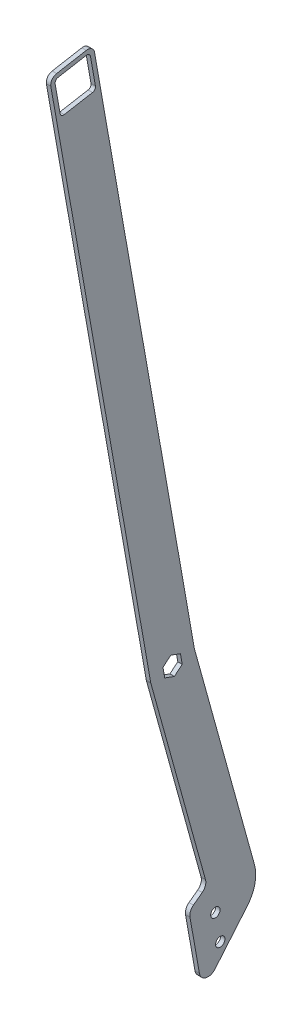
ISO-10303-21;
HEADER;
FILE_DESCRIPTION(('STEP AP214'),'2;1');
FILE_NAME('part.step','',(''),(''),'','','');
FILE_SCHEMA(('AUTOMOTIVE_DESIGN { 1 0 10303 214 1 1 1 1 }'));
ENDSEC;
DATA;
#1=APPLICATION_CONTEXT('core data for automotive mechanical design processes');
#2=APPLICATION_PROTOCOL_DEFINITION('international standard','automotive_design',2000,#1);
#3=PRODUCT_CONTEXT('',#1,'mechanical');
#4=PRODUCT('Part','Part','',(#3));
#5=PRODUCT_RELATED_PRODUCT_CATEGORY('part','',(#4));
#6=PRODUCT_DEFINITION_FORMATION('','',#4);
#7=PRODUCT_DEFINITION_CONTEXT('part definition',#1,'design');
#8=PRODUCT_DEFINITION('design','',#6,#7);
#9=PRODUCT_DEFINITION_SHAPE('','',#8);
#10=(LENGTH_UNIT() NAMED_UNIT(*) SI_UNIT(.MILLI.,.METRE.));
#11=(NAMED_UNIT(*) PLANE_ANGLE_UNIT() SI_UNIT($,.RADIAN.));
#12=(NAMED_UNIT(*) SI_UNIT($,.STERADIAN.) SOLID_ANGLE_UNIT());
#13=UNCERTAINTY_MEASURE_WITH_UNIT(LENGTH_MEASURE(1.E-05),#10,'distance_accuracy_value','');
#14=(GEOMETRIC_REPRESENTATION_CONTEXT(3) GLOBAL_UNCERTAINTY_ASSIGNED_CONTEXT((#13)) GLOBAL_UNIT_ASSIGNED_CONTEXT((#10,
#11,#12)) REPRESENTATION_CONTEXT('',''));
#15=CARTESIAN_POINT('',(0.,0.,0.));
#16=DIRECTION('',(0.,0.,1.));
#17=DIRECTION('',(1.,0.,0.));
#18=AXIS2_PLACEMENT_3D('',#15,#16,#17);
#19=CARTESIAN_POINT('',(1.5875,1029.81232235076,-1069.3559825674));
#20=DIRECTION('',(1.,0.,0.));
#21=DIRECTION('',(0.,0.,-1.));
#22=AXIS2_PLACEMENT_3D('',#19,#20,#21);
#23=CYLINDRICAL_SURFACE('',#22,6.35000000000008);
#24=DIRECTION('',(1.,0.,0.));
#25=VECTOR('',#24,1.);
#26=CARTESIAN_POINT('',(1.5875,1028.11826823169,-1063.23612303946));
#27=LINE('',#26,#25);
#28=CARTESIAN_POINT('',(-1.5875,1028.11826823169,-1063.23612303946));
#29=VERTEX_POINT('',#28);
#30=CARTESIAN_POINT('',(1.5875,1028.11826823169,-1063.23612303946));
#31=VERTEX_POINT('',#30);
#32=EDGE_CURVE('E201',#29,#31,#27,.T.);
#33=ORIENTED_EDGE('',*,*,#32,.F.);
#34=CARTESIAN_POINT('',(-1.5875,1029.81232235076,-1069.3559825674));
#35=DIRECTION('',(1.,0.,0.));
#36=DIRECTION('',(0.,0.,-1.));
#37=AXIS2_PLACEMENT_3D('',#34,#35,#36);
#38=CIRCLE('',#37,6.35000000000008);
#39=CARTESIAN_POINT('',(-1.5875,1028.70965642258,-1063.10245333577));
#40=VERTEX_POINT('',#39);
#41=EDGE_CURVE('E197',#29,#40,#38,.F.);
#42=ORIENTED_EDGE('',*,*,#41,.T.);
#43=DIRECTION('',(1.,0.,0.));
#44=VECTOR('',#43,1.);
#45=CARTESIAN_POINT('',(1.5875,1028.70965642258,-1063.10245333577));
#46=LINE('',#45,#44);
#47=CARTESIAN_POINT('',(1.5875,1028.70965642258,-1063.10245333577));
#48=VERTEX_POINT('',#47);
#49=EDGE_CURVE('E196',#48,#40,#46,.F.);
#50=ORIENTED_EDGE('',*,*,#49,.F.);
#51=CARTESIAN_POINT('',(1.5875,1029.81232235076,-1069.3559825674));
#52=DIRECTION('',(1.,0.,0.));
#53=DIRECTION('',(0.,0.,-1.));
#54=AXIS2_PLACEMENT_3D('',#51,#52,#53);
#55=CIRCLE('',#54,6.35000000000008);
#56=EDGE_CURVE('E20',#31,#48,#55,.F.);
#57=ORIENTED_EDGE('',*,*,#56,.F.);
#58=EDGE_LOOP('',(#33,#42,#50,#57));
#59=FACE_BOUND('',#58,.T.);
#60=ADVANCED_FACE('F17',(#59),#23,.F.);
#61=CARTESIAN_POINT('',(1.5875,1024.29899270983,-1038.08833640926));
#62=DIRECTION('',(1.,0.,0.));
#63=DIRECTION('',(0.,0.,-1.));
#64=AXIS2_PLACEMENT_3D('',#61,#62,#63);
#65=CYLINDRICAL_SURFACE('',#64,6.35000000000008);
#66=CARTESIAN_POINT('',(-1.5875,1024.29899270983,-1038.08833640926));
#67=DIRECTION('',(1.,0.,0.));
#68=DIRECTION('',(0.,0.,-1.));
#69=AXIS2_PLACEMENT_3D('',#66,#67,#68);
#70=CIRCLE('',#69,6.35000000000008);
#71=CARTESIAN_POINT('',(-1.5875,1023.19632678165,-1031.83480717763));
#72=VERTEX_POINT('',#71);
#73=CARTESIAN_POINT('',(-1.5875,1022.60493859076,-1031.96847688132));
#74=VERTEX_POINT('',#73);
#75=EDGE_CURVE('E341',#72,#74,#70,.T.);
#76=ORIENTED_EDGE('',*,*,#75,.T.);
#77=DIRECTION('',(1.,0.,0.));
#78=VECTOR('',#77,1.);
#79=CARTESIAN_POINT('',(1.5875,1022.60493859077,-1031.96847688132));
#80=LINE('',#79,#78);
#81=CARTESIAN_POINT('',(1.5875,1022.60493859076,-1031.96847688132));
#82=VERTEX_POINT('',#81);
#83=EDGE_CURVE('E303',#74,#82,#80,.T.);
#84=ORIENTED_EDGE('',*,*,#83,.T.);
#85=CARTESIAN_POINT('',(1.5875,1024.29899270983,-1038.08833640926));
#86=DIRECTION('',(1.,0.,0.));
#87=DIRECTION('',(0.,0.,-1.));
#88=AXIS2_PLACEMENT_3D('',#85,#86,#87);
#89=CIRCLE('',#88,6.35000000000008);
#90=CARTESIAN_POINT('',(1.5875,1023.19632678165,-1031.83480717763));
#91=VERTEX_POINT('',#90);
#92=EDGE_CURVE('E194',#82,#91,#89,.F.);
#93=ORIENTED_EDGE('',*,*,#92,.T.);
#94=DIRECTION('',(1.,0.,0.));
#95=VECTOR('',#94,1.);
#96=CARTESIAN_POINT('',(1.5875,1023.19632678165,-1031.83480717763));
#97=LINE('',#96,#95);
#98=EDGE_CURVE('E310',#72,#91,#97,.T.);
#99=ORIENTED_EDGE('',*,*,#98,.F.);
#100=EDGE_LOOP('',(#76,#84,#93,#99));
#101=FACE_BOUND('',#100,.T.);
#102=ADVANCED_FACE('F405',(#101),#65,.T.);
#103=CARTESIAN_POINT('',(-1.5875,0.,0.));
#104=DIRECTION('',(1.,0.,0.));
#105=DIRECTION('',(0.,0.,-1.));
#106=AXIS2_PLACEMENT_3D('',#103,#104,#105);
#107=PLANE('',#106);
#108=CARTESIAN_POINT('',(-1.5875,1408.67683289626,-969.538397319688));
#109=DIRECTION('',(-1.,0.,0.));
#110=DIRECTION('',(0.,0.,1.));
#111=AXIS2_PLACEMENT_3D('',#108,#109,#110);
#112=CIRCLE('',#111,2.53999999999999);
#113=CARTESIAN_POINT('',(-1.5875,1408.23576652499,-967.036985627036));
#114=VERTEX_POINT('',#113);
#115=CARTESIAN_POINT('',(-1.5875,1406.17542120361,-969.979463690962));
#116=VERTEX_POINT('',#115);
#117=EDGE_CURVE('E241',#114,#116,#112,.F.);
#118=ORIENTED_EDGE('',*,*,#117,.T.);
#119=DIRECTION('',(0.,-0.173648177666937,0.984807753012207));
#120=VECTOR('',#119,1.);
#121=CARTESIAN_POINT('',(-1.5875,1197.8977864223,211.221699877206));
#122=LINE('',#121,#120);
#123=CARTESIAN_POINT('',(-1.5875,1409.74805881093,-990.240898401436));
#124=VERTEX_POINT('',#123);
#125=EDGE_CURVE('E245',#124,#116,#122,.T.);
#126=ORIENTED_EDGE('',*,*,#125,.F.);
#127=CARTESIAN_POINT('',(-1.5875,1412.24947050358,-989.799832030161));
#128=DIRECTION('',(-1.,0.,0.));
#129=DIRECTION('',(0.,0.,1.));
#130=AXIS2_PLACEMENT_3D('',#127,#128,#129);
#131=CIRCLE('',#130,2.53999999999999);
#132=CARTESIAN_POINT('',(-1.5875,1412.69053687485,-992.301243722812));
#133=VERTEX_POINT('',#132);
#134=EDGE_CURVE('E220',#124,#133,#131,.F.);
#135=ORIENTED_EDGE('',*,*,#134,.T.);
#136=DIRECTION('',(0.,0.984807753012207,0.173648177666935));
#137=VECTOR('',#136,1.);
#138=CARTESIAN_POINT('',(-1.5875,212.2913387599,-1203.96400997129));
#139=LINE('',#138,#137);
#140=CARTESIAN_POINT('',(-1.5875,1432.95197158533,-988.728606115493));
#141=VERTEX_POINT('',#140);
#142=EDGE_CURVE('E226',#133,#141,#139,.T.);
#143=ORIENTED_EDGE('',*,*,#142,.T.);
#144=CARTESIAN_POINT('',(-1.5875,1432.51090521405,-986.227194422842));
#145=DIRECTION('',(1.,0.,0.));
#146=DIRECTION('',(0.,0.,-1.));
#147=AXIS2_PLACEMENT_3D('',#144,#145,#146);
#148=CIRCLE('',#147,2.53999999999999);
#149=CARTESIAN_POINT('',(-1.5875,1435.0123169067,-985.786128051568));
#150=VERTEX_POINT('',#149);
#151=EDGE_CURVE('E229',#141,#150,#148,.T.);
#152=ORIENTED_EDGE('',*,*,#151,.T.);
#153=DIRECTION('',(0.,-0.173648177666945,0.984807753012205));
#154=VECTOR('',#153,1.);
#155=CARTESIAN_POINT('',(-1.5875,1223.16204451806,215.676470227082));
#156=LINE('',#155,#154);
#157=CARTESIAN_POINT('',(-1.5875,1431.43967929938,-965.524693341094));
#158=VERTEX_POINT('',#157);
#159=EDGE_CURVE('E232',#150,#158,#156,.T.);
#160=ORIENTED_EDGE('',*,*,#159,.T.);
#161=CARTESIAN_POINT('',(-1.5875,1428.93826760673,-965.965759712368));
#162=DIRECTION('',(1.,0.,0.));
#163=DIRECTION('',(0.,0.,-1.));
#164=AXIS2_PLACEMENT_3D('',#161,#162,#163);
#165=CIRCLE('',#164,2.53999999999999);
#166=CARTESIAN_POINT('',(-1.5875,1428.49720123546,-963.464348019717));
#167=VERTEX_POINT('',#166);
#168=EDGE_CURVE('E235',#158,#167,#165,.T.);
#169=ORIENTED_EDGE('',*,*,#168,.T.);
#170=DIRECTION('',(0.,-0.984807753012207,-0.173648177666937));
#171=VECTOR('',#170,1.);
#172=CARTESIAN_POINT('',(-1.5875,207.836568410034,-1178.69975187552));
#173=LINE('',#172,#171);
#174=EDGE_CURVE('E238',#167,#114,#173,.T.);
#175=ORIENTED_EDGE('',*,*,#174,.T.);
#176=EDGE_LOOP('',(#118,#126,#135,#143,#152,#160,#169,#175));
#177=FACE_BOUND('',#176,.T.);
#178=DIRECTION('',(0.,0.642787609686544,-0.766044443118974));
#179=VECTOR('',#178,1.);
#180=CARTESIAN_POINT('',(-1.5875,81.21058753333,68.1437740469084));
#181=LINE('',#180,#179);
#182=CARTESIAN_POINT('',(-1.5875,1018.43314955319,-1048.79458130059));
#183=VERTEX_POINT('',#182);
#184=CARTESIAN_POINT('',(-1.5875,1023.14629226664,-1054.41148606176));
#185=VERTEX_POINT('',#184);
#186=EDGE_CURVE('E242',#183,#185,#181,.T.);
#187=ORIENTED_EDGE('',*,*,#186,.T.);
#188=DIRECTION('',(0.,0.984807753012207,0.173648177666934));
#189=VECTOR('',#188,1.);
#190=CARTESIAN_POINT('',(-1.5875,211.16661951315,-1197.58541015503));
#191=LINE('',#190,#189);
#192=CARTESIAN_POINT('',(-1.5875,1030.36724583717,-1053.13823712083));
#193=VERTEX_POINT('',#192);
#194=EDGE_CURVE('E252',#185,#193,#191,.T.);
#195=ORIENTED_EDGE('',*,*,#194,.T.);
#196=DIRECTION('',(0.,0.342020143325652,0.939692620785915));
#197=VECTOR('',#196,1.);
#198=CARTESIAN_POINT('',(-1.5875,1248.30927949546,-454.347420894612));
#199=LINE('',#198,#197);
#200=CARTESIAN_POINT('',(-1.5875,1032.87505669425,-1046.24808341874));
#201=VERTEX_POINT('',#200);
#202=EDGE_CURVE('E258',#193,#201,#199,.T.);
#203=ORIENTED_EDGE('',*,*,#202,.T.);
#204=DIRECTION('',(0.,-0.642787609686544,0.766044443118974));
#205=VECTOR('',#204,1.);
#206=CARTESIAN_POINT('',(-1.5875,90.9393519609409,76.3071766899275));
#207=LINE('',#206,#205);
#208=CARTESIAN_POINT('',(-1.5875,1028.1619139808,-1040.63117865757));
#209=VERTEX_POINT('',#208);
#210=EDGE_CURVE('E264',#201,#209,#207,.T.);
#211=ORIENTED_EDGE('',*,*,#210,.T.);
#212=DIRECTION('',(0.,-0.984807753012227,-0.173648177666822));
#213=VECTOR('',#212,1.);
#214=CARTESIAN_POINT('',(-1.5875,208.961287656628,-1185.0783516917));
#215=LINE('',#214,#213);
#216=CARTESIAN_POINT('',(-1.5875,1020.94096041027,-1041.9044275985));
#217=VERTEX_POINT('',#216);
#218=EDGE_CURVE('E270',#209,#217,#215,.T.);
#219=ORIENTED_EDGE('',*,*,#218,.T.);
#220=DIRECTION('',(0.,-0.342020143325639,-0.939692620785919));
#221=VECTOR('',#220,1.);
#222=CARTESIAN_POINT('',(-1.5875,1236.37518321148,-450.003765074358));
#223=LINE('',#222,#221);
#224=EDGE_CURVE('E276',#217,#183,#223,.T.);
#225=ORIENTED_EDGE('',*,*,#224,.T.);
#226=EDGE_LOOP('',(#187,#195,#203,#211,#219,#225));
#227=FACE_BOUND('',#226,.T.);
#228=CARTESIAN_POINT('',(-1.5875,837.529761972813,-1081.64702736242));
#229=DIRECTION('',(-1.,0.,0.));
#230=DIRECTION('',(0.,0.,1.));
#231=AXIS2_PLACEMENT_3D('',#228,#229,#230);
#232=CIRCLE('',#231,3.35280000000004);
#233=CARTESIAN_POINT('',(-1.5875,837.529761972813,-1078.29422736242));
#234=VERTEX_POINT('',#233);
#235=EDGE_CURVE('E279',#234,#234,#232,.F.);
#236=ORIENTED_EDGE('',*,*,#235,.T.);
#237=EDGE_LOOP('',(#236));
#238=FACE_BOUND('',#237,.T.);
#239=CARTESIAN_POINT('',(-1.5875,857.415984929388,-1078.1405497108));
#240=DIRECTION('',(-1.,0.,0.));
#241=DIRECTION('',(0.,0.,1.));
#242=AXIS2_PLACEMENT_3D('',#239,#240,#241);
#243=CIRCLE('',#242,3.35280000000004);
#244=CARTESIAN_POINT('',(-1.5875,857.415984929388,-1074.7877497108));
#245=VERTEX_POINT('',#244);
#246=EDGE_CURVE('E283',#245,#245,#243,.F.);
#247=ORIENTED_EDGE('',*,*,#246,.T.);
#248=EDGE_LOOP('',(#247));
#249=FACE_BOUND('',#248,.T.);
#250=CARTESIAN_POINT('',(-1.5875,866.455600683505,-1081.63120340782));
#251=DIRECTION('',(1.,0.,0.));
#252=DIRECTION('',(0.,0.,-1.));
#253=AXIS2_PLACEMENT_3D('',#250,#251,#252);
#254=CIRCLE('',#253,25.4000000000001);
#255=CARTESIAN_POINT('',(-1.5875,850.128795397467,-1101.08873226304));
#256=VERTEX_POINT('',#255);
#257=CARTESIAN_POINT('',(-1.5875,873.231817159775,-1106.11064151957));
#258=VERTEX_POINT('',#257);
#259=EDGE_CURVE('E328',#256,#258,#254,.T.);
#260=ORIENTED_EDGE('',*,*,#259,.F.);
#261=DIRECTION('',(0.,-0.766044443118977,0.64278760968654));
#262=VECTOR('',#261,1.);
#263=CARTESIAN_POINT('',(-1.5875,-190.927620496256,-227.538677651876));
#264=LINE('',#263,#262);
#265=CARTESIAN_POINT('',(-1.5875,822.411555806516,-1077.83120674502));
#266=VERTEX_POINT('',#265);
#267=EDGE_CURVE('E333',#256,#266,#264,.T.);
#268=ORIENTED_EDGE('',*,*,#267,.T.);
#269=CARTESIAN_POINT('',(-1.5875,826.493257128025,-1072.96682453122));
#270=DIRECTION('',(1.,0.,0.));
#271=DIRECTION('',(0.,0.,-1.));
#272=AXIS2_PLACEMENT_3D('',#269,#270,#271);
#273=CIRCLE('',#272,6.35000000000008);
#274=CARTESIAN_POINT('',(-1.5875,825.390591199841,-1066.71329529959));
#275=VERTEX_POINT('',#274);
#276=EDGE_CURVE('E284',#275,#266,#273,.T.);
#277=ORIENTED_EDGE('',*,*,#276,.F.);
#278=DIRECTION('',(0.,-0.984807753012207,-0.173648177666934));
#279=VECTOR('',#278,1.);
#280=CARTESIAN_POINT('',(-1.5875,207.307288764502,-1175.69805784433));
#281=LINE('',#280,#279);
#282=CARTESIAN_POINT('',(-1.5875,863.641196979978,-1059.96868147211));
#283=VERTEX_POINT('',#282);
#284=EDGE_CURVE('E288',#283,#275,#281,.T.);
#285=ORIENTED_EDGE('',*,*,#284,.F.);
#286=CARTESIAN_POINT('',(-1.5875,864.743862908163,-1066.22221070374));
#287=DIRECTION('',(-1.,0.,0.));
#288=DIRECTION('',(0.,0.,1.));
#289=AXIS2_PLACEMENT_3D('',#286,#287,#288);
#290=CIRCLE('',#289,6.35000000000008);
#291=CARTESIAN_POINT('',(-1.5875,869.847939873459,-1062.44452644849));
#292=VERTEX_POINT('',#291);
#293=EDGE_CURVE('E292',#292,#283,#290,.F.);
#294=ORIENTED_EDGE('',*,*,#293,.F.);
#295=DIRECTION('',(0.,-0.594910906338142,0.80379164807799));
#296=VECTOR('',#295,1.);
#297=CARTESIAN_POINT('',(-1.5875,53.9478212079292,39.9284407676045));
#298=LINE('',#297,#296);
#299=CARTESIAN_POINT('',(-1.5875,874.507260884624,-1068.73979398282));
#300=VERTEX_POINT('',#299);
#301=EDGE_CURVE('E296',#300,#292,#298,.T.);
#302=ORIENTED_EDGE('',*,*,#301,.F.);
#303=CARTESIAN_POINT('',(-1.5875,879.611337849919,-1064.96210972757));
#304=DIRECTION('',(-1.,0.,0.));
#305=DIRECTION('',(0.,0.,1.));
#306=AXIS2_PLACEMENT_3D('',#303,#304,#305);
#307=CIRCLE('',#306,6.35000000000008);
#308=CARTESIAN_POINT('',(-1.5875,881.305391968987,-1071.08196925551));
#309=VERTEX_POINT('',#308);
#310=EDGE_CURVE('E302',#300,#309,#307,.F.);
#311=ORIENTED_EDGE('',*,*,#310,.T.);
#312=DIRECTION('',(0.,0.963757405974189,0.266780176231111));
#313=VECTOR('',#312,1.);
#314=CARTESIAN_POINT('',(-1.5875,338.111323005632,-1221.44492215988));
#315=LINE('',#314,#313);
#316=EDGE_CURVE('E306',#309,#74,#315,.T.);
#317=ORIENTED_EDGE('',*,*,#316,.T.);
#318=ORIENTED_EDGE('',*,*,#75,.F.);
#319=DIRECTION('',(0.,-0.984807753012207,-0.173648177666935));
#320=VECTOR('',#319,1.);
#321=CARTESIAN_POINT('',(-1.5875,207.307288764503,-1175.69805784433));
#322=LINE('',#321,#320);
#323=CARTESIAN_POINT('',(-1.5875,1428.46820392846,-960.374440714282));
#324=VERTEX_POINT('',#323);
#325=EDGE_CURVE('E313',#324,#72,#322,.T.);
#326=ORIENTED_EDGE('',*,*,#325,.F.);
#327=CARTESIAN_POINT('',(-1.5875,1429.35033667101,-965.377264099584));
#328=DIRECTION('',(-1.,0.,0.));
#329=DIRECTION('',(0.,0.,1.));
#330=AXIS2_PLACEMENT_3D('',#327,#328,#329);
#331=CIRCLE('',#330,5.07999999999997);
#332=CARTESIAN_POINT('',(-1.5875,1434.35316005631,-964.495131357036));
#333=VERTEX_POINT('',#332);
#334=EDGE_CURVE('E317',#333,#324,#331,.F.);
#335=ORIENTED_EDGE('',*,*,#334,.F.);
#336=DIRECTION('',(0.,-0.173648177666947,0.984807753012205));
#337=VECTOR('',#336,1.);
#338=CARTESIAN_POINT('',(-1.5875,1226.16373854924,216.205749872612));
#339=LINE('',#338,#337);
#340=CARTESIAN_POINT('',(-1.5875,1438.10222421214,-985.757130744569));
#341=VERTEX_POINT('',#340);
#342=EDGE_CURVE('E321',#341,#333,#339,.T.);
#343=ORIENTED_EDGE('',*,*,#342,.F.);
#344=CARTESIAN_POINT('',(-1.5875,1433.09940082684,-986.639263487117));
#345=DIRECTION('',(-1.,0.,0.));
#346=DIRECTION('',(0.,0.,1.));
#347=AXIS2_PLACEMENT_3D('',#344,#345,#346);
#348=CIRCLE('',#347,5.07999999999997);
#349=CARTESIAN_POINT('',(-1.5875,1433.98153356939,-991.642086872419));
#350=VERTEX_POINT('',#349);
#351=EDGE_CURVE('E322',#350,#341,#348,.F.);
#352=ORIENTED_EDGE('',*,*,#351,.F.);
#353=DIRECTION('',(0.,0.984807753012207,0.173648177666935));
#354=VECTOR('',#353,1.);
#355=CARTESIAN_POINT('',(-1.5875,212.820618405429,-1206.96570400247));
#356=LINE('',#355,#354);
#357=EDGE_CURVE('E200',#40,#350,#356,.T.);
#358=ORIENTED_EDGE('',*,*,#357,.F.);
#359=ORIENTED_EDGE('',*,*,#41,.F.);
#360=DIRECTION('',(0.,0.963757405974189,0.266780176231111));
#361=VECTOR('',#360,1.);
#362=CARTESIAN_POINT('',(-1.5875,346.542983201162,-1251.90473770128));
#363=LINE('',#362,#361);
#364=EDGE_CURVE('E327',#258,#29,#363,.T.);
#365=ORIENTED_EDGE('',*,*,#364,.F.);
#366=EDGE_LOOP('',(#260,#268,#277,#285,#294,#302,#311,#317,#318,#326,#335,#343,#352,#358,#359,#365));
#367=FACE_BOUND('',#366,.T.);
#368=ADVANCED_FACE('F457',(#177,#227,#238,#249,#367),#107,.F.);
#369=CARTESIAN_POINT('',(1.5875,-190.927620496256,-227.538677651876));
#370=DIRECTION('',(0.,0.64278760968654,0.766044443118977));
#371=DIRECTION('',(0.,-0.766044443118977,0.64278760968654));
#372=AXIS2_PLACEMENT_3D('',#369,#370,#371);
#373=PLANE('',#372);
#374=DIRECTION('',(1.,0.,0.));
#375=VECTOR('',#374,1.);
#376=CARTESIAN_POINT('',(1.5875,850.128795397467,-1101.08873226304));
#377=LINE('',#376,#375);
#378=CARTESIAN_POINT('',(1.5875,850.128795397467,-1101.08873226304));
#379=VERTEX_POINT('',#378);
#380=EDGE_CURVE('E330',#379,#256,#377,.F.);
#381=ORIENTED_EDGE('',*,*,#380,.F.);
#382=DIRECTION('',(0.,0.766044443118978,-0.642787609686539));
#383=VECTOR('',#382,1.);
#384=CARTESIAN_POINT('',(1.5875,822.411555806516,-1077.83120674502));
#385=LINE('',#384,#383);
#386=CARTESIAN_POINT('',(1.5875,822.411555806516,-1077.83120674502));
#387=VERTEX_POINT('',#386);
#388=EDGE_CURVE('E216',#387,#379,#385,.T.);
#389=ORIENTED_EDGE('',*,*,#388,.F.);
#390=DIRECTION('',(1.,0.,0.));
#391=VECTOR('',#390,1.);
#392=CARTESIAN_POINT('',(1.5875,822.411555806516,-1077.83120674502));
#393=LINE('',#392,#391);
#394=EDGE_CURVE('E280',#266,#387,#393,.T.);
#395=ORIENTED_EDGE('',*,*,#394,.F.);
#396=ORIENTED_EDGE('',*,*,#267,.F.);
#397=EDGE_LOOP('',(#381,#389,#395,#396));
#398=FACE_BOUND('',#397,.T.);
#399=ADVANCED_FACE('F584',(#398),#373,.F.);
#400=CARTESIAN_POINT('',(1.5875,866.455600683505,-1081.63120340782));
#401=DIRECTION('',(1.,0.,0.));
#402=DIRECTION('',(0.,0.,-1.));
#403=AXIS2_PLACEMENT_3D('',#400,#401,#402);
#404=CYLINDRICAL_SURFACE('',#403,25.4000000000001);
#405=DIRECTION('',(1.,0.,0.));
#406=VECTOR('',#405,1.);
#407=CARTESIAN_POINT('',(1.5875,873.231817159776,-1106.11064151957));
#408=LINE('',#407,#406);
#409=CARTESIAN_POINT('',(1.5875,873.231817159775,-1106.11064151957));
#410=VERTEX_POINT('',#409);
#411=EDGE_CURVE('E324',#410,#258,#408,.F.);
#412=ORIENTED_EDGE('',*,*,#411,.F.);
#413=CARTESIAN_POINT('',(1.5875,866.455600683505,-1081.63120340782));
#414=DIRECTION('',(1.,0.,0.));
#415=DIRECTION('',(0.,0.,-1.));
#416=AXIS2_PLACEMENT_3D('',#413,#414,#415);
#417=CIRCLE('',#416,25.4000000000001);
#418=EDGE_CURVE('E211',#379,#410,#417,.T.);
#419=ORIENTED_EDGE('',*,*,#418,.F.);
#420=ORIENTED_EDGE('',*,*,#380,.T.);
#421=ORIENTED_EDGE('',*,*,#259,.T.);
#422=EDGE_LOOP('',(#412,#419,#420,#421));
#423=FACE_BOUND('',#422,.T.);
#424=ADVANCED_FACE('F580',(#423),#404,.T.);
#425=CARTESIAN_POINT('',(1.5875,346.542983201162,-1251.90473770128));
#426=DIRECTION('',(0.,0.266780176231111,-0.963757405974189));
#427=DIRECTION('',(0.,0.963757405974189,0.266780176231111));
#428=AXIS2_PLACEMENT_3D('',#425,#426,#427);
#429=PLANE('',#428);
#430=ORIENTED_EDGE('',*,*,#364,.T.);
#431=ORIENTED_EDGE('',*,*,#32,.T.);
#432=DIRECTION('',(0.,0.963757405974189,0.26678017623111));
#433=VECTOR('',#432,1.);
#434=CARTESIAN_POINT('',(1.5875,873.231817159775,-1106.11064151957));
#435=LINE('',#434,#433);
#436=EDGE_CURVE('E193',#410,#31,#435,.T.);
#437=ORIENTED_EDGE('',*,*,#436,.F.);
#438=ORIENTED_EDGE('',*,*,#411,.T.);
#439=EDGE_LOOP('',(#430,#431,#437,#438));
#440=FACE_BOUND('',#439,.T.);
#441=ADVANCED_FACE('F577',(#440),#429,.T.);
#442=CARTESIAN_POINT('',(1.5875,212.820618405429,-1206.96570400247));
#443=DIRECTION('',(0.,0.173648177666935,-0.984807753012207));
#444=DIRECTION('',(0.,0.984807753012207,0.173648177666935));
#445=AXIS2_PLACEMENT_3D('',#442,#443,#444);
#446=PLANE('',#445);
#447=ORIENTED_EDGE('',*,*,#357,.T.);
#448=DIRECTION('',(-1.,0.,0.));
#449=VECTOR('',#448,1.);
#450=CARTESIAN_POINT('',(1.5875,1433.98153356939,-991.642086872419));
#451=LINE('',#450,#449);
#452=CARTESIAN_POINT('',(1.5875,1433.98153356939,-991.642086872419));
#453=VERTEX_POINT('',#452);
#454=EDGE_CURVE('E205',#453,#350,#451,.T.);
#455=ORIENTED_EDGE('',*,*,#454,.F.);
#456=DIRECTION('',(0.,0.984807753012207,0.173648177666935));
#457=VECTOR('',#456,1.);
#458=CARTESIAN_POINT('',(1.5875,1028.70965642258,-1063.10245333577));
#459=LINE('',#458,#457);
#460=EDGE_CURVE('E191',#48,#453,#459,.T.);
#461=ORIENTED_EDGE('',*,*,#460,.F.);
#462=ORIENTED_EDGE('',*,*,#49,.T.);
#463=EDGE_LOOP('',(#447,#455,#461,#462));
#464=FACE_BOUND('',#463,.T.);
#465=ADVANCED_FACE('F203',(#464),#446,.T.);
#466=CARTESIAN_POINT('',(1.5875,1433.09940082684,-986.639263487117));
#467=DIRECTION('',(-1.,0.,0.));
#468=DIRECTION('',(0.,0.,1.));
#469=AXIS2_PLACEMENT_3D('',#466,#467,#468);
#470=CYLINDRICAL_SURFACE('',#469,5.07999999999997);
#471=ORIENTED_EDGE('',*,*,#351,.T.);
#472=DIRECTION('',(1.,0.,0.));
#473=VECTOR('',#472,1.);
#474=CARTESIAN_POINT('',(1.5875,1438.10222421214,-985.757130744569));
#475=LINE('',#474,#473);
#476=CARTESIAN_POINT('',(1.5875,1438.10222421214,-985.757130744569));
#477=VERTEX_POINT('',#476);
#478=EDGE_CURVE('E318',#477,#341,#475,.F.);
#479=ORIENTED_EDGE('',*,*,#478,.F.);
#480=CARTESIAN_POINT('',(1.5875,1433.09940082684,-986.639263487117));
#481=DIRECTION('',(-1.,0.,0.));
#482=DIRECTION('',(0.,0.,1.));
#483=AXIS2_PLACEMENT_3D('',#480,#481,#482);
#484=CIRCLE('',#483,5.07999999999997);
#485=EDGE_CURVE('E207',#453,#477,#484,.F.);
#486=ORIENTED_EDGE('',*,*,#485,.F.);
#487=ORIENTED_EDGE('',*,*,#454,.T.);
#488=EDGE_LOOP('',(#471,#479,#486,#487));
#489=FACE_BOUND('',#488,.T.);
#490=ADVANCED_FACE('F570',(#489),#470,.T.);
#491=CARTESIAN_POINT('',(1.5875,1226.16373854924,216.205749872612));
#492=DIRECTION('',(0.,0.984807753012205,0.173648177666947));
#493=DIRECTION('',(0.,-0.173648177666947,0.984807753012205));
#494=AXIS2_PLACEMENT_3D('',#491,#492,#493);
#495=PLANE('',#494);
#496=DIRECTION('',(0.,-0.173648177666949,0.984807753012205));
#497=VECTOR('',#496,1.);
#498=CARTESIAN_POINT('',(1.5875,1438.10222421214,-985.757130744569));
#499=LINE('',#498,#497);
#500=CARTESIAN_POINT('',(1.5875,1434.35316005631,-964.495131357036));
#501=VERTEX_POINT('',#500);
#502=EDGE_CURVE('E209',#477,#501,#499,.T.);
#503=ORIENTED_EDGE('',*,*,#502,.F.);
#504=ORIENTED_EDGE('',*,*,#478,.T.);
#505=ORIENTED_EDGE('',*,*,#342,.T.);
#506=DIRECTION('',(-1.,0.,0.));
#507=VECTOR('',#506,1.);
#508=CARTESIAN_POINT('',(1.5875,1434.35316005631,-964.495131357036));
#509=LINE('',#508,#507);
#510=EDGE_CURVE('E314',#501,#333,#509,.T.);
#511=ORIENTED_EDGE('',*,*,#510,.F.);
#512=EDGE_LOOP('',(#503,#504,#505,#511));
#513=FACE_BOUND('',#512,.T.);
#514=ADVANCED_FACE('F566',(#513),#495,.T.);
#515=CARTESIAN_POINT('',(1.5875,1429.35033667101,-965.377264099584));
#516=DIRECTION('',(-1.,0.,0.));
#517=DIRECTION('',(0.,0.,1.));
#518=AXIS2_PLACEMENT_3D('',#515,#516,#517);
#519=CYLINDRICAL_SURFACE('',#518,5.07999999999997);
#520=ORIENTED_EDGE('',*,*,#510,.T.);
#521=ORIENTED_EDGE('',*,*,#334,.T.);
#522=DIRECTION('',(1.,0.,0.));
#523=VECTOR('',#522,1.);
#524=CARTESIAN_POINT('',(1.5875,1428.46820392846,-960.374440714282));
#525=LINE('',#524,#523);
#526=CARTESIAN_POINT('',(1.5875,1428.46820392846,-960.374440714282));
#527=VERTEX_POINT('',#526);
#528=EDGE_CURVE('E307',#527,#324,#525,.F.);
#529=ORIENTED_EDGE('',*,*,#528,.F.);
#530=CARTESIAN_POINT('',(1.5875,1429.35033667101,-965.377264099584));
#531=DIRECTION('',(-1.,0.,0.));
#532=DIRECTION('',(0.,0.,1.));
#533=AXIS2_PLACEMENT_3D('',#530,#531,#532);
#534=CIRCLE('',#533,5.07999999999997);
#535=EDGE_CURVE('E382',#501,#527,#534,.F.);
#536=ORIENTED_EDGE('',*,*,#535,.F.);
#537=EDGE_LOOP('',(#520,#521,#529,#536));
#538=FACE_BOUND('',#537,.T.);
#539=ADVANCED_FACE('F563',(#538),#519,.T.);
#540=CARTESIAN_POINT('',(1.5875,207.307288764503,-1175.69805784433));
#541=DIRECTION('',(0.,-0.173648177666935,0.984807753012207));
#542=DIRECTION('',(0.,-0.984807753012207,-0.173648177666935));
#543=AXIS2_PLACEMENT_3D('',#540,#541,#542);
#544=PLANE('',#543);
#545=DIRECTION('',(0.,-0.984807753012207,-0.173648177666935));
#546=VECTOR('',#545,1.);
#547=CARTESIAN_POINT('',(1.5875,1428.46820392846,-960.374440714281));
#548=LINE('',#547,#546);
#549=EDGE_CURVE('E383',#527,#91,#548,.T.);
#550=ORIENTED_EDGE('',*,*,#549,.F.);
#551=ORIENTED_EDGE('',*,*,#528,.T.);
#552=ORIENTED_EDGE('',*,*,#325,.T.);
#553=ORIENTED_EDGE('',*,*,#98,.T.);
#554=EDGE_LOOP('',(#550,#551,#552,#553));
#555=FACE_BOUND('',#554,.T.);
#556=ADVANCED_FACE('F412',(#555),#544,.T.);
#557=CARTESIAN_POINT('',(1.5875,338.111323005632,-1221.44492215988));
#558=DIRECTION('',(0.,0.266780176231111,-0.963757405974189));
#559=DIRECTION('',(0.,0.963757405974189,0.266780176231111));
#560=AXIS2_PLACEMENT_3D('',#557,#558,#559);
#561=PLANE('',#560);
#562=ORIENTED_EDGE('',*,*,#83,.F.);
#563=ORIENTED_EDGE('',*,*,#316,.F.);
#564=DIRECTION('',(-1.,0.,0.));
#565=VECTOR('',#564,1.);
#566=CARTESIAN_POINT('',(1.5875,881.305391968987,-1071.08196925551));
#567=LINE('',#566,#565);
#568=CARTESIAN_POINT('',(1.5875,881.305391968987,-1071.08196925551));
#569=VERTEX_POINT('',#568);
#570=EDGE_CURVE('E300',#309,#569,#567,.F.);
#571=ORIENTED_EDGE('',*,*,#570,.T.);
#572=DIRECTION('',(0.,-0.963757405974189,-0.26678017623111));
#573=VECTOR('',#572,1.);
#574=CARTESIAN_POINT('',(1.5875,1022.60493859077,-1031.96847688132));
#575=LINE('',#574,#573);
#576=EDGE_CURVE('E381',#82,#569,#575,.T.);
#577=ORIENTED_EDGE('',*,*,#576,.F.);
#578=EDGE_LOOP('',(#562,#563,#571,#577));
#579=FACE_BOUND('',#578,.T.);
#580=ADVANCED_FACE('F556',(#579),#561,.F.);
#581=CARTESIAN_POINT('',(1.5875,879.611337849919,-1064.96210972757));
#582=DIRECTION('',(-1.,0.,0.));
#583=DIRECTION('',(0.,0.,1.));
#584=AXIS2_PLACEMENT_3D('',#581,#582,#583);
#585=CYLINDRICAL_SURFACE('',#584,6.35000000000008);
#586=ORIENTED_EDGE('',*,*,#570,.F.);
#587=ORIENTED_EDGE('',*,*,#310,.F.);
#588=DIRECTION('',(1.,0.,0.));
#589=VECTOR('',#588,1.);
#590=CARTESIAN_POINT('',(1.5875,874.507260884624,-1068.73979398282));
#591=LINE('',#590,#589);
#592=CARTESIAN_POINT('',(1.5875,874.507260884624,-1068.73979398282));
#593=VERTEX_POINT('',#592);
#594=EDGE_CURVE('E297',#593,#300,#591,.F.);
#595=ORIENTED_EDGE('',*,*,#594,.F.);
#596=CARTESIAN_POINT('',(1.5875,879.611337849919,-1064.96210972757));
#597=DIRECTION('',(-1.,0.,0.));
#598=DIRECTION('',(0.,0.,1.));
#599=AXIS2_PLACEMENT_3D('',#596,#597,#598);
#600=CIRCLE('',#599,6.35000000000008);
#601=EDGE_CURVE('E378',#569,#593,#600,.T.);
#602=ORIENTED_EDGE('',*,*,#601,.F.);
#603=EDGE_LOOP('',(#586,#587,#595,#602));
#604=FACE_BOUND('',#603,.T.);
#605=ADVANCED_FACE('F552',(#604),#585,.F.);
#606=CARTESIAN_POINT('',(1.5875,53.9478212079292,39.9284407676045));
#607=DIRECTION('',(0.,0.80379164807799,0.594910906338142));
#608=DIRECTION('',(0.,-0.594910906338142,0.80379164807799));
#609=AXIS2_PLACEMENT_3D('',#606,#607,#608);
#610=PLANE('',#609);
#611=ORIENTED_EDGE('',*,*,#301,.T.);
#612=DIRECTION('',(-1.,0.,0.));
#613=VECTOR('',#612,1.);
#614=CARTESIAN_POINT('',(1.5875,869.847939873459,-1062.44452644849));
#615=LINE('',#614,#613);
#616=CARTESIAN_POINT('',(1.5875,869.847939873459,-1062.44452644849));
#617=VERTEX_POINT('',#616);
#618=EDGE_CURVE('E293',#617,#292,#615,.T.);
#619=ORIENTED_EDGE('',*,*,#618,.F.);
#620=DIRECTION('',(0.,-0.594910906338149,0.803791648077984));
#621=VECTOR('',#620,1.);
#622=CARTESIAN_POINT('',(1.5875,874.507260884624,-1068.73979398282));
#623=LINE('',#622,#621);
#624=EDGE_CURVE('E377',#593,#617,#623,.T.);
#625=ORIENTED_EDGE('',*,*,#624,.F.);
#626=ORIENTED_EDGE('',*,*,#594,.T.);
#627=EDGE_LOOP('',(#611,#619,#625,#626));
#628=FACE_BOUND('',#627,.T.);
#629=ADVANCED_FACE('F548',(#628),#610,.T.);
#630=CARTESIAN_POINT('',(1.5875,864.743862908163,-1066.22221070374));
#631=DIRECTION('',(-1.,0.,0.));
#632=DIRECTION('',(0.,0.,1.));
#633=AXIS2_PLACEMENT_3D('',#630,#631,#632);
#634=CYLINDRICAL_SURFACE('',#633,6.35000000000008);
#635=ORIENTED_EDGE('',*,*,#618,.T.);
#636=ORIENTED_EDGE('',*,*,#293,.T.);
#637=DIRECTION('',(1.,0.,0.));
#638=VECTOR('',#637,1.);
#639=CARTESIAN_POINT('',(1.5875,863.641196979979,-1059.96868147211));
#640=LINE('',#639,#638);
#641=CARTESIAN_POINT('',(1.5875,863.641196979978,-1059.96868147211));
#642=VERTEX_POINT('',#641);
#643=EDGE_CURVE('E289',#642,#283,#640,.F.);
#644=ORIENTED_EDGE('',*,*,#643,.F.);
#645=CARTESIAN_POINT('',(1.5875,864.743862908163,-1066.22221070374));
#646=DIRECTION('',(-1.,0.,0.));
#647=DIRECTION('',(0.,0.,1.));
#648=AXIS2_PLACEMENT_3D('',#645,#646,#647);
#649=CIRCLE('',#648,6.35000000000008);
#650=EDGE_CURVE('E375',#617,#642,#649,.F.);
#651=ORIENTED_EDGE('',*,*,#650,.F.);
#652=EDGE_LOOP('',(#635,#636,#644,#651));
#653=FACE_BOUND('',#652,.T.);
#654=ADVANCED_FACE('F544',(#653),#634,.T.);
#655=CARTESIAN_POINT('',(1.5875,207.307288764502,-1175.69805784433));
#656=DIRECTION('',(0.,-0.173648177666934,0.984807753012207));
#657=DIRECTION('',(0.,-0.984807753012207,-0.173648177666934));
#658=AXIS2_PLACEMENT_3D('',#655,#656,#657);
#659=PLANE('',#658);
#660=ORIENTED_EDGE('',*,*,#284,.T.);
#661=DIRECTION('',(1.,0.,0.));
#662=VECTOR('',#661,1.);
#663=CARTESIAN_POINT('',(1.5875,825.390591199841,-1066.71329529959));
#664=LINE('',#663,#662);
#665=CARTESIAN_POINT('',(1.5875,825.390591199841,-1066.71329529959));
#666=VERTEX_POINT('',#665);
#667=EDGE_CURVE('E285',#666,#275,#664,.F.);
#668=ORIENTED_EDGE('',*,*,#667,.F.);
#669=DIRECTION('',(0.,-0.984807753012206,-0.173648177666939));
#670=VECTOR('',#669,1.);
#671=CARTESIAN_POINT('',(1.5875,863.641196979979,-1059.96868147211));
#672=LINE('',#671,#670);
#673=EDGE_CURVE('E374',#642,#666,#672,.T.);
#674=ORIENTED_EDGE('',*,*,#673,.F.);
#675=ORIENTED_EDGE('',*,*,#643,.T.);
#676=EDGE_LOOP('',(#660,#668,#674,#675));
#677=FACE_BOUND('',#676,.T.);
#678=ADVANCED_FACE('F540',(#677),#659,.T.);
#679=CARTESIAN_POINT('',(1.5875,826.493257128025,-1072.96682453122));
#680=DIRECTION('',(1.,0.,0.));
#681=DIRECTION('',(0.,0.,-1.));
#682=AXIS2_PLACEMENT_3D('',#679,#680,#681);
#683=CYLINDRICAL_SURFACE('',#682,6.35000000000008);
#684=ORIENTED_EDGE('',*,*,#276,.T.);
#685=ORIENTED_EDGE('',*,*,#394,.T.);
#686=CARTESIAN_POINT('',(1.5875,826.493257128025,-1072.96682453122));
#687=DIRECTION('',(1.,0.,0.));
#688=DIRECTION('',(0.,0.,-1.));
#689=AXIS2_PLACEMENT_3D('',#686,#687,#688);
#690=CIRCLE('',#689,6.35000000000008);
#691=EDGE_CURVE('E371',#666,#387,#690,.T.);
#692=ORIENTED_EDGE('',*,*,#691,.F.);
#693=ORIENTED_EDGE('',*,*,#667,.T.);
#694=EDGE_LOOP('',(#684,#685,#692,#693));
#695=FACE_BOUND('',#694,.T.);
#696=ADVANCED_FACE('F536',(#695),#683,.T.);
#697=CARTESIAN_POINT('',(1.5875,857.415984929388,-1078.1405497108));
#698=DIRECTION('',(-1.,0.,0.));
#699=DIRECTION('',(0.,0.,1.));
#700=AXIS2_PLACEMENT_3D('',#697,#698,#699);
#701=CYLINDRICAL_SURFACE('',#700,3.35280000000004);
#702=CARTESIAN_POINT('',(1.5875,857.415984929388,-1078.1405497108));
#703=DIRECTION('',(-1.,0.,0.));
#704=DIRECTION('',(0.,0.,1.));
#705=AXIS2_PLACEMENT_3D('',#702,#703,#704);
#706=CIRCLE('',#705,3.35280000000004);
#707=CARTESIAN_POINT('',(1.5875,857.415984929388,-1074.7877497108));
#708=VERTEX_POINT('',#707);
#709=EDGE_CURVE('E368',#708,#708,#706,.T.);
#710=ORIENTED_EDGE('',*,*,#709,.F.);
#711=EDGE_LOOP('',(#710));
#712=FACE_BOUND('',#711,.T.);
#713=ORIENTED_EDGE('',*,*,#246,.F.);
#714=EDGE_LOOP('',(#713));
#715=FACE_BOUND('',#714,.T.);
#716=ADVANCED_FACE('F532',(#712,#715),#701,.F.);
#717=CARTESIAN_POINT('',(1.5875,837.529761972813,-1081.64702736242));
#718=DIRECTION('',(-1.,0.,0.));
#719=DIRECTION('',(0.,0.,1.));
#720=AXIS2_PLACEMENT_3D('',#717,#718,#719);
#721=CYLINDRICAL_SURFACE('',#720,3.35280000000004);
#722=CARTESIAN_POINT('',(1.5875,837.529761972813,-1081.64702736242));
#723=DIRECTION('',(-1.,0.,0.));
#724=DIRECTION('',(0.,0.,1.));
#725=AXIS2_PLACEMENT_3D('',#722,#723,#724);
#726=CIRCLE('',#725,3.35280000000004);
#727=CARTESIAN_POINT('',(1.5875,837.529761972813,-1078.29422736242));
#728=VERTEX_POINT('',#727);
#729=EDGE_CURVE('E364',#728,#728,#726,.T.);
#730=ORIENTED_EDGE('',*,*,#729,.F.);
#731=EDGE_LOOP('',(#730));
#732=FACE_BOUND('',#731,.T.);
#733=ORIENTED_EDGE('',*,*,#235,.F.);
#734=EDGE_LOOP('',(#733));
#735=FACE_BOUND('',#734,.T.);
#736=ADVANCED_FACE('F528',(#732,#735),#721,.F.);
#737=CARTESIAN_POINT('',(1.5875,1236.37518321148,-450.003765074358));
#738=DIRECTION('',(0.,-0.939692620785919,0.342020143325639));
#739=DIRECTION('',(0.,-0.342020143325639,-0.939692620785919));
#740=AXIS2_PLACEMENT_3D('',#737,#738,#739);
#741=PLANE('',#740);
#742=DIRECTION('',(1.,0.,0.));
#743=VECTOR('',#742,1.);
#744=CARTESIAN_POINT('',(1.5875,1020.94096041027,-1041.9044275985));
#745=LINE('',#744,#743);
#746=CARTESIAN_POINT('',(1.5875,1020.94096041027,-1041.9044275985));
#747=VERTEX_POINT('',#746);
#748=EDGE_CURVE('E273',#217,#747,#745,.T.);
#749=ORIENTED_EDGE('',*,*,#748,.T.);
#750=DIRECTION('',(0.,0.342020143325649,0.939692620785915));
#751=VECTOR('',#750,1.);
#752=CARTESIAN_POINT('',(1.5875,1018.43314955319,-1048.79458130059));
#753=LINE('',#752,#751);
#754=CARTESIAN_POINT('',(1.5875,1018.43314955319,-1048.79458130059));
#755=VERTEX_POINT('',#754);
#756=EDGE_CURVE('E367',#755,#747,#753,.T.);
#757=ORIENTED_EDGE('',*,*,#756,.F.);
#758=DIRECTION('',(1.,0.,0.));
#759=VECTOR('',#758,1.);
#760=CARTESIAN_POINT('',(1.5875,1018.43314955319,-1048.79458130059));
#761=LINE('',#760,#759);
#762=EDGE_CURVE('E246',#755,#183,#761,.F.);
#763=ORIENTED_EDGE('',*,*,#762,.T.);
#764=ORIENTED_EDGE('',*,*,#224,.F.);
#765=EDGE_LOOP('',(#749,#757,#763,#764));
#766=FACE_BOUND('',#765,.T.);
#767=ADVANCED_FACE('F524',(#766),#741,.F.);
#768=CARTESIAN_POINT('',(1.5875,208.961287656628,-1185.0783516917));
#769=DIRECTION('',(0.,-0.173648177666822,0.984807753012227));
#770=DIRECTION('',(0.,-0.984807753012227,-0.173648177666822));
#771=AXIS2_PLACEMENT_3D('',#768,#769,#770);
#772=PLANE('',#771);
#773=DIRECTION('',(1.,0.,0.));
#774=VECTOR('',#773,1.);
#775=CARTESIAN_POINT('',(1.5875,1028.1619139808,-1040.63117865757));
#776=LINE('',#775,#774);
#777=CARTESIAN_POINT('',(1.5875,1028.1619139808,-1040.63117865757));
#778=VERTEX_POINT('',#777);
#779=EDGE_CURVE('E267',#209,#778,#776,.T.);
#780=ORIENTED_EDGE('',*,*,#779,.T.);
#781=DIRECTION('',(0.,0.984807753012222,0.173648177666851));
#782=VECTOR('',#781,1.);
#783=CARTESIAN_POINT('',(1.5875,1020.94096041027,-1041.9044275985));
#784=LINE('',#783,#782);
#785=EDGE_CURVE('E424',#747,#778,#784,.T.);
#786=ORIENTED_EDGE('',*,*,#785,.F.);
#787=ORIENTED_EDGE('',*,*,#748,.F.);
#788=ORIENTED_EDGE('',*,*,#218,.F.);
#789=EDGE_LOOP('',(#780,#786,#787,#788));
#790=FACE_BOUND('',#789,.T.);
#791=ADVANCED_FACE('F520',(#790),#772,.F.);
#792=CARTESIAN_POINT('',(1.5875,90.9393519609409,76.3071766899275));
#793=DIRECTION('',(0.,0.766044443118974,0.642787609686544));
#794=DIRECTION('',(0.,-0.642787609686544,0.766044443118974));
#795=AXIS2_PLACEMENT_3D('',#792,#793,#794);
#796=PLANE('',#795);
#797=DIRECTION('',(1.,0.,0.));
#798=VECTOR('',#797,1.);
#799=CARTESIAN_POINT('',(1.5875,1032.87505669425,-1046.24808341874));
#800=LINE('',#799,#798);
#801=CARTESIAN_POINT('',(1.5875,1032.87505669425,-1046.24808341874));
#802=VERTEX_POINT('',#801);
#803=EDGE_CURVE('E261',#201,#802,#800,.T.);
#804=ORIENTED_EDGE('',*,*,#803,.T.);
#805=DIRECTION('',(0.,0.642787609686527,-0.766044443118989));
#806=VECTOR('',#805,1.);
#807=CARTESIAN_POINT('',(1.5875,1028.1619139808,-1040.63117865757));
#808=LINE('',#807,#806);
#809=EDGE_CURVE('E427',#778,#802,#808,.T.);
#810=ORIENTED_EDGE('',*,*,#809,.F.);
#811=ORIENTED_EDGE('',*,*,#779,.F.);
#812=ORIENTED_EDGE('',*,*,#210,.F.);
#813=EDGE_LOOP('',(#804,#810,#811,#812));
#814=FACE_BOUND('',#813,.T.);
#815=ADVANCED_FACE('F516',(#814),#796,.F.);
#816=CARTESIAN_POINT('',(1.5875,1248.30927949546,-454.347420894612));
#817=DIRECTION('',(0.,0.939692620785915,-0.342020143325652));
#818=DIRECTION('',(0.,0.342020143325652,0.939692620785915));
#819=AXIS2_PLACEMENT_3D('',#816,#817,#818);
#820=PLANE('',#819);
#821=DIRECTION('',(1.,0.,0.));
#822=VECTOR('',#821,1.);
#823=CARTESIAN_POINT('',(1.5875,1030.36724583717,-1053.13823712083));
#824=LINE('',#823,#822);
#825=CARTESIAN_POINT('',(1.5875,1030.36724583717,-1053.13823712083));
#826=VERTEX_POINT('',#825);
#827=EDGE_CURVE('E255',#193,#826,#824,.T.);
#828=ORIENTED_EDGE('',*,*,#827,.T.);
#829=DIRECTION('',(0.,-0.342020143325635,-0.939692620785921));
#830=VECTOR('',#829,1.);
#831=CARTESIAN_POINT('',(1.5875,1032.87505669425,-1046.24808341874));
#832=LINE('',#831,#830);
#833=EDGE_CURVE('E430',#802,#826,#832,.T.);
#834=ORIENTED_EDGE('',*,*,#833,.F.);
#835=ORIENTED_EDGE('',*,*,#803,.F.);
#836=ORIENTED_EDGE('',*,*,#202,.F.);
#837=EDGE_LOOP('',(#828,#834,#835,#836));
#838=FACE_BOUND('',#837,.T.);
#839=ADVANCED_FACE('F512',(#838),#820,.F.);
#840=CARTESIAN_POINT('',(1.5875,211.16661951315,-1197.58541015503));
#841=DIRECTION('',(0.,0.173648177666934,-0.984807753012207));
#842=DIRECTION('',(0.,0.984807753012207,0.173648177666934));
#843=AXIS2_PLACEMENT_3D('',#840,#841,#842);
#844=PLANE('',#843);
#845=DIRECTION('',(1.,0.,0.));
#846=VECTOR('',#845,1.);
#847=CARTESIAN_POINT('',(1.5875,1023.14629226664,-1054.41148606176));
#848=LINE('',#847,#846);
#849=CARTESIAN_POINT('',(1.5875,1023.14629226664,-1054.41148606176));
#850=VERTEX_POINT('',#849);
#851=EDGE_CURVE('E249',#185,#850,#848,.T.);
#852=ORIENTED_EDGE('',*,*,#851,.T.);
#853=DIRECTION('',(0.,-0.984807753012202,-0.173648177666964));
#854=VECTOR('',#853,1.);
#855=CARTESIAN_POINT('',(1.5875,1030.36724583717,-1053.13823712083));
#856=LINE('',#855,#854);
#857=EDGE_CURVE('E433',#826,#850,#856,.T.);
#858=ORIENTED_EDGE('',*,*,#857,.F.);
#859=ORIENTED_EDGE('',*,*,#827,.F.);
#860=ORIENTED_EDGE('',*,*,#194,.F.);
#861=EDGE_LOOP('',(#852,#858,#859,#860));
#862=FACE_BOUND('',#861,.T.);
#863=ADVANCED_FACE('F508',(#862),#844,.F.);
#864=CARTESIAN_POINT('',(1.5875,81.21058753333,68.1437740469084));
#865=DIRECTION('',(0.,-0.766044443118974,-0.642787609686544));
#866=DIRECTION('',(0.,0.642787609686544,-0.766044443118974));
#867=AXIS2_PLACEMENT_3D('',#864,#865,#866);
#868=PLANE('',#867);
#869=ORIENTED_EDGE('',*,*,#762,.F.);
#870=DIRECTION('',(0.,-0.642787609686544,0.766044443118974));
#871=VECTOR('',#870,1.);
#872=CARTESIAN_POINT('',(1.5875,1023.14629226664,-1054.41148606176));
#873=LINE('',#872,#871);
#874=EDGE_CURVE('E436',#850,#755,#873,.T.);
#875=ORIENTED_EDGE('',*,*,#874,.F.);
#876=ORIENTED_EDGE('',*,*,#851,.F.);
#877=ORIENTED_EDGE('',*,*,#186,.F.);
#878=EDGE_LOOP('',(#869,#875,#876,#877));
#879=FACE_BOUND('',#878,.T.);
#880=ADVANCED_FACE('F505',(#879),#868,.F.);
#881=CARTESIAN_POINT('',(1.5875,1197.8977864223,211.221699877206));
#882=DIRECTION('',(0.,0.984807753012207,0.173648177666937));
#883=DIRECTION('',(0.,-0.173648177666937,0.984807753012207));
#884=AXIS2_PLACEMENT_3D('',#881,#882,#883);
#885=PLANE('',#884);
#886=ORIENTED_EDGE('',*,*,#125,.T.);
#887=DIRECTION('',(-1.,0.,0.));
#888=VECTOR('',#887,1.);
#889=CARTESIAN_POINT('',(1.5875,1406.17542120361,-969.979463690962));
#890=LINE('',#889,#888);
#891=CARTESIAN_POINT('',(1.5875,1406.17542120361,-969.979463690962));
#892=VERTEX_POINT('',#891);
#893=EDGE_CURVE('E239',#116,#892,#890,.F.);
#894=ORIENTED_EDGE('',*,*,#893,.T.);
#895=DIRECTION('',(0.,-0.173648177666939,0.984807753012206));
#896=VECTOR('',#895,1.);
#897=CARTESIAN_POINT('',(1.5875,1409.74805881093,-990.240898401436));
#898=LINE('',#897,#896);
#899=CARTESIAN_POINT('',(1.5875,1409.74805881093,-990.240898401436));
#900=VERTEX_POINT('',#899);
#901=EDGE_CURVE('E363',#900,#892,#898,.T.);
#902=ORIENTED_EDGE('',*,*,#901,.F.);
#903=DIRECTION('',(-1.,0.,0.));
#904=VECTOR('',#903,1.);
#905=CARTESIAN_POINT('',(1.5875,1409.74805881093,-990.240898401436));
#906=LINE('',#905,#904);
#907=EDGE_CURVE('E221',#900,#124,#906,.T.);
#908=ORIENTED_EDGE('',*,*,#907,.T.);
#909=EDGE_LOOP('',(#886,#894,#902,#908));
#910=FACE_BOUND('',#909,.T.);
#911=ADVANCED_FACE('F478',(#910),#885,.T.);
#912=CARTESIAN_POINT('',(1.5875,1408.67683289626,-969.538397319688));
#913=DIRECTION('',(-1.,0.,0.));
#914=DIRECTION('',(0.,0.,1.));
#915=AXIS2_PLACEMENT_3D('',#912,#913,#914);
#916=CYLINDRICAL_SURFACE('',#915,2.53999999999999);
#917=ORIENTED_EDGE('',*,*,#893,.F.);
#918=ORIENTED_EDGE('',*,*,#117,.F.);
#919=DIRECTION('',(1.,0.,0.));
#920=VECTOR('',#919,1.);
#921=CARTESIAN_POINT('',(1.5875,1408.23576652499,-967.036985627036));
#922=LINE('',#921,#920);
#923=CARTESIAN_POINT('',(1.5875,1408.23576652499,-967.036985627036));
#924=VERTEX_POINT('',#923);
#925=EDGE_CURVE('E236',#114,#924,#922,.T.);
#926=ORIENTED_EDGE('',*,*,#925,.T.);
#927=CARTESIAN_POINT('',(1.5875,1408.67683289626,-969.538397319688));
#928=DIRECTION('',(-1.,0.,0.));
#929=DIRECTION('',(0.,0.,1.));
#930=AXIS2_PLACEMENT_3D('',#927,#928,#929);
#931=CIRCLE('',#930,2.53999999999999);
#932=EDGE_CURVE('E360',#892,#924,#931,.T.);
#933=ORIENTED_EDGE('',*,*,#932,.F.);
#934=EDGE_LOOP('',(#917,#918,#926,#933));
#935=FACE_BOUND('',#934,.T.);
#936=ADVANCED_FACE('F476',(#935),#916,.F.);
#937=CARTESIAN_POINT('',(1.5875,207.836568410034,-1178.69975187552));
#938=DIRECTION('',(0.,-0.173648177666937,0.984807753012207));
#939=DIRECTION('',(0.,-0.984807753012207,-0.173648177666937));
#940=AXIS2_PLACEMENT_3D('',#937,#938,#939);
#941=PLANE('',#940);
#942=ORIENTED_EDGE('',*,*,#925,.F.);
#943=ORIENTED_EDGE('',*,*,#174,.F.);
#944=DIRECTION('',(1.,0.,0.));
#945=VECTOR('',#944,1.);
#946=CARTESIAN_POINT('',(1.5875,1428.49720123546,-963.464348019717));
#947=LINE('',#946,#945);
#948=CARTESIAN_POINT('',(1.5875,1428.49720123546,-963.464348019717));
#949=VERTEX_POINT('',#948);
#950=EDGE_CURVE('E233',#167,#949,#947,.T.);
#951=ORIENTED_EDGE('',*,*,#950,.T.);
#952=DIRECTION('',(0.,0.984807753012206,0.173648177666939));
#953=VECTOR('',#952,1.);
#954=CARTESIAN_POINT('',(1.5875,1408.23576652499,-967.036985627036));
#955=LINE('',#954,#953);
#956=EDGE_CURVE('E359',#924,#949,#955,.T.);
#957=ORIENTED_EDGE('',*,*,#956,.F.);
#958=EDGE_LOOP('',(#942,#943,#951,#957));
#959=FACE_BOUND('',#958,.T.);
#960=ADVANCED_FACE('F471',(#959),#941,.F.);
#961=CARTESIAN_POINT('',(1.5875,1428.93826760673,-965.965759712368));
#962=DIRECTION('',(1.,0.,0.));
#963=DIRECTION('',(0.,0.,-1.));
#964=AXIS2_PLACEMENT_3D('',#961,#962,#963);
#965=CYLINDRICAL_SURFACE('',#964,2.53999999999999);
#966=ORIENTED_EDGE('',*,*,#950,.F.);
#967=ORIENTED_EDGE('',*,*,#168,.F.);
#968=DIRECTION('',(1.,0.,0.));
#969=VECTOR('',#968,1.);
#970=CARTESIAN_POINT('',(1.5875,1431.43967929938,-965.524693341094));
#971=LINE('',#970,#969);
#972=CARTESIAN_POINT('',(1.5875,1431.43967929938,-965.524693341094));
#973=VERTEX_POINT('',#972);
#974=EDGE_CURVE('E230',#158,#973,#971,.T.);
#975=ORIENTED_EDGE('',*,*,#974,.T.);
#976=CARTESIAN_POINT('',(1.5875,1428.93826760673,-965.965759712368));
#977=DIRECTION('',(1.,0.,0.));
#978=DIRECTION('',(0.,0.,-1.));
#979=AXIS2_PLACEMENT_3D('',#976,#977,#978);
#980=CIRCLE('',#979,2.53999999999999);
#981=EDGE_CURVE('E356',#949,#973,#980,.F.);
#982=ORIENTED_EDGE('',*,*,#981,.F.);
#983=EDGE_LOOP('',(#966,#967,#975,#982));
#984=FACE_BOUND('',#983,.T.);
#985=ADVANCED_FACE('F466',(#984),#965,.F.);
#986=CARTESIAN_POINT('',(1.5875,1223.16204451806,215.676470227082));
#987=DIRECTION('',(0.,0.984807753012205,0.173648177666945));
#988=DIRECTION('',(0.,-0.173648177666945,0.984807753012205));
#989=AXIS2_PLACEMENT_3D('',#986,#987,#988);
#990=PLANE('',#989);
#991=DIRECTION('',(1.,0.,0.));
#992=VECTOR('',#991,1.);
#993=CARTESIAN_POINT('',(1.5875,1435.0123169067,-985.786128051568));
#994=LINE('',#993,#992);
#995=CARTESIAN_POINT('',(1.5875,1435.0123169067,-985.786128051568));
#996=VERTEX_POINT('',#995);
#997=EDGE_CURVE('E227',#150,#996,#994,.T.);
#998=ORIENTED_EDGE('',*,*,#997,.T.);
#999=DIRECTION('',(0.,0.173648177666941,-0.984807753012206));
#1000=VECTOR('',#999,1.);
#1001=CARTESIAN_POINT('',(1.5875,1431.43967929938,-965.524693341094));
#1002=LINE('',#1001,#1000);
#1003=EDGE_CURVE('E355',#973,#996,#1002,.T.);
#1004=ORIENTED_EDGE('',*,*,#1003,.F.);
#1005=ORIENTED_EDGE('',*,*,#974,.F.);
#1006=ORIENTED_EDGE('',*,*,#159,.F.);
#1007=EDGE_LOOP('',(#998,#1004,#1005,#1006));
#1008=FACE_BOUND('',#1007,.T.);
#1009=ADVANCED_FACE('F461',(#1008),#990,.F.);
#1010=CARTESIAN_POINT('',(1.5875,1432.51090521405,-986.227194422842));
#1011=DIRECTION('',(1.,0.,0.));
#1012=DIRECTION('',(0.,0.,-1.));
#1013=AXIS2_PLACEMENT_3D('',#1010,#1011,#1012);
#1014=CYLINDRICAL_SURFACE('',#1013,2.53999999999999);
#1015=ORIENTED_EDGE('',*,*,#997,.F.);
#1016=ORIENTED_EDGE('',*,*,#151,.F.);
#1017=DIRECTION('',(1.,0.,0.));
#1018=VECTOR('',#1017,1.);
#1019=CARTESIAN_POINT('',(1.5875,1432.95197158533,-988.728606115493));
#1020=LINE('',#1019,#1018);
#1021=CARTESIAN_POINT('',(1.5875,1432.95197158533,-988.728606115493));
#1022=VERTEX_POINT('',#1021);
#1023=EDGE_CURVE('E224',#141,#1022,#1020,.T.);
#1024=ORIENTED_EDGE('',*,*,#1023,.T.);
#1025=CARTESIAN_POINT('',(1.5875,1432.51090521405,-986.227194422842));
#1026=DIRECTION('',(1.,0.,0.));
#1027=DIRECTION('',(0.,0.,-1.));
#1028=AXIS2_PLACEMENT_3D('',#1025,#1026,#1027);
#1029=CIRCLE('',#1028,2.53999999999999);
#1030=EDGE_CURVE('E352',#996,#1022,#1029,.F.);
#1031=ORIENTED_EDGE('',*,*,#1030,.F.);
#1032=EDGE_LOOP('',(#1015,#1016,#1024,#1031));
#1033=FACE_BOUND('',#1032,.T.);
#1034=ADVANCED_FACE('F454',(#1033),#1014,.F.);
#1035=CARTESIAN_POINT('',(1.5875,212.2913387599,-1203.96400997129));
#1036=DIRECTION('',(0.,0.173648177666935,-0.984807753012207));
#1037=DIRECTION('',(0.,0.984807753012207,0.173648177666935));
#1038=AXIS2_PLACEMENT_3D('',#1035,#1036,#1037);
#1039=PLANE('',#1038);
#1040=ORIENTED_EDGE('',*,*,#1023,.F.);
#1041=ORIENTED_EDGE('',*,*,#142,.F.);
#1042=DIRECTION('',(-1.,0.,0.));
#1043=VECTOR('',#1042,1.);
#1044=CARTESIAN_POINT('',(1.5875,1412.69053687485,-992.301243722813));
#1045=LINE('',#1044,#1043);
#1046=CARTESIAN_POINT('',(1.5875,1412.69053687485,-992.301243722812));
#1047=VERTEX_POINT('',#1046);
#1048=EDGE_CURVE('E35',#133,#1047,#1045,.F.);
#1049=ORIENTED_EDGE('',*,*,#1048,.T.);
#1050=DIRECTION('',(0.,-0.984807753012207,-0.173648177666937));
#1051=VECTOR('',#1050,1.);
#1052=CARTESIAN_POINT('',(1.5875,1432.95197158533,-988.728606115493));
#1053=LINE('',#1052,#1051);
#1054=EDGE_CURVE('E26',#1022,#1047,#1053,.T.);
#1055=ORIENTED_EDGE('',*,*,#1054,.F.);
#1056=EDGE_LOOP('',(#1040,#1041,#1049,#1055));
#1057=FACE_BOUND('',#1056,.T.);
#1058=ADVANCED_FACE('F450',(#1057),#1039,.F.);
#1059=CARTESIAN_POINT('',(1.5875,1412.24947050358,-989.799832030161));
#1060=DIRECTION('',(-1.,0.,0.));
#1061=DIRECTION('',(0.,0.,1.));
#1062=AXIS2_PLACEMENT_3D('',#1059,#1060,#1061);
#1063=CYLINDRICAL_SURFACE('',#1062,2.53999999999999);
#1064=ORIENTED_EDGE('',*,*,#1048,.F.);
#1065=ORIENTED_EDGE('',*,*,#134,.F.);
#1066=ORIENTED_EDGE('',*,*,#907,.F.);
#1067=CARTESIAN_POINT('',(1.5875,1412.24947050358,-989.799832030161));
#1068=DIRECTION('',(-1.,0.,0.));
#1069=DIRECTION('',(0.,0.,1.));
#1070=AXIS2_PLACEMENT_3D('',#1067,#1068,#1069);
#1071=CIRCLE('',#1070,2.53999999999999);
#1072=EDGE_CURVE('E11',#1047,#900,#1071,.T.);
#1073=ORIENTED_EDGE('',*,*,#1072,.F.);
#1074=EDGE_LOOP('',(#1064,#1065,#1066,#1073));
#1075=FACE_BOUND('',#1074,.T.);
#1076=ADVANCED_FACE('F482',(#1075),#1063,.F.);
#1077=CARTESIAN_POINT('',(1.5875,0.,0.));
#1078=DIRECTION('',(1.,0.,0.));
#1079=DIRECTION('',(0.,0.,-1.));
#1080=AXIS2_PLACEMENT_3D('',#1077,#1078,#1079);
#1081=PLANE('',#1080);
#1082=ORIENTED_EDGE('',*,*,#1054,.T.);
#1083=ORIENTED_EDGE('',*,*,#1072,.T.);
#1084=ORIENTED_EDGE('',*,*,#901,.T.);
#1085=ORIENTED_EDGE('',*,*,#932,.T.);
#1086=ORIENTED_EDGE('',*,*,#956,.T.);
#1087=ORIENTED_EDGE('',*,*,#981,.T.);
#1088=ORIENTED_EDGE('',*,*,#1003,.T.);
#1089=ORIENTED_EDGE('',*,*,#1030,.T.);
#1090=EDGE_LOOP('',(#1082,#1083,#1084,#1085,#1086,#1087,#1088,#1089));
#1091=FACE_BOUND('',#1090,.T.);
#1092=ORIENTED_EDGE('',*,*,#857,.T.);
#1093=ORIENTED_EDGE('',*,*,#874,.T.);
#1094=ORIENTED_EDGE('',*,*,#756,.T.);
#1095=ORIENTED_EDGE('',*,*,#785,.T.);
#1096=ORIENTED_EDGE('',*,*,#809,.T.);
#1097=ORIENTED_EDGE('',*,*,#833,.T.);
#1098=EDGE_LOOP('',(#1092,#1093,#1094,#1095,#1096,#1097));
#1099=FACE_BOUND('',#1098,.T.);
#1100=ORIENTED_EDGE('',*,*,#729,.T.);
#1101=EDGE_LOOP('',(#1100));
#1102=FACE_BOUND('',#1101,.T.);
#1103=ORIENTED_EDGE('',*,*,#709,.T.);
#1104=EDGE_LOOP('',(#1103));
#1105=FACE_BOUND('',#1104,.T.);
#1106=ORIENTED_EDGE('',*,*,#673,.T.);
#1107=ORIENTED_EDGE('',*,*,#691,.T.);
#1108=ORIENTED_EDGE('',*,*,#388,.T.);
#1109=ORIENTED_EDGE('',*,*,#418,.T.);
#1110=ORIENTED_EDGE('',*,*,#436,.T.);
#1111=ORIENTED_EDGE('',*,*,#56,.T.);
#1112=ORIENTED_EDGE('',*,*,#460,.T.);
#1113=ORIENTED_EDGE('',*,*,#485,.T.);
#1114=ORIENTED_EDGE('',*,*,#502,.T.);
#1115=ORIENTED_EDGE('',*,*,#535,.T.);
#1116=ORIENTED_EDGE('',*,*,#549,.T.);
#1117=ORIENTED_EDGE('',*,*,#92,.F.);
#1118=ORIENTED_EDGE('',*,*,#576,.T.);
#1119=ORIENTED_EDGE('',*,*,#601,.T.);
#1120=ORIENTED_EDGE('',*,*,#624,.T.);
#1121=ORIENTED_EDGE('',*,*,#650,.T.);
#1122=EDGE_LOOP('',(#1106,#1107,#1108,#1109,#1110,#1111,#1112,#1113,#1114,#1115,#1116,#1117,
#1118,#1119,#1120,#1121));
#1123=FACE_BOUND('',#1122,.T.);
#1124=ADVANCED_FACE('F188',(#1091,#1099,#1102,#1105,#1123),#1081,.T.);
#1125=CLOSED_SHELL('',(#60,#102,#368,#399,#424,#441,#465,#490,#514,#539,#556,#580,#605,#629,
#654,#678,#696,#716,#736,#767,#791,#815,#839,#863,#880,#911,#936,#960,#985,#1009,#1034,#1058,
#1076,#1124));
#1126=MANIFOLD_SOLID_BREP('B1',#1125);
#1127=ADVANCED_BREP_SHAPE_REPRESENTATION('',(#18,#1126),#14);
#1128=SHAPE_DEFINITION_REPRESENTATION(#9,#1127);
ENDSEC;
END-ISO-10303-21;
